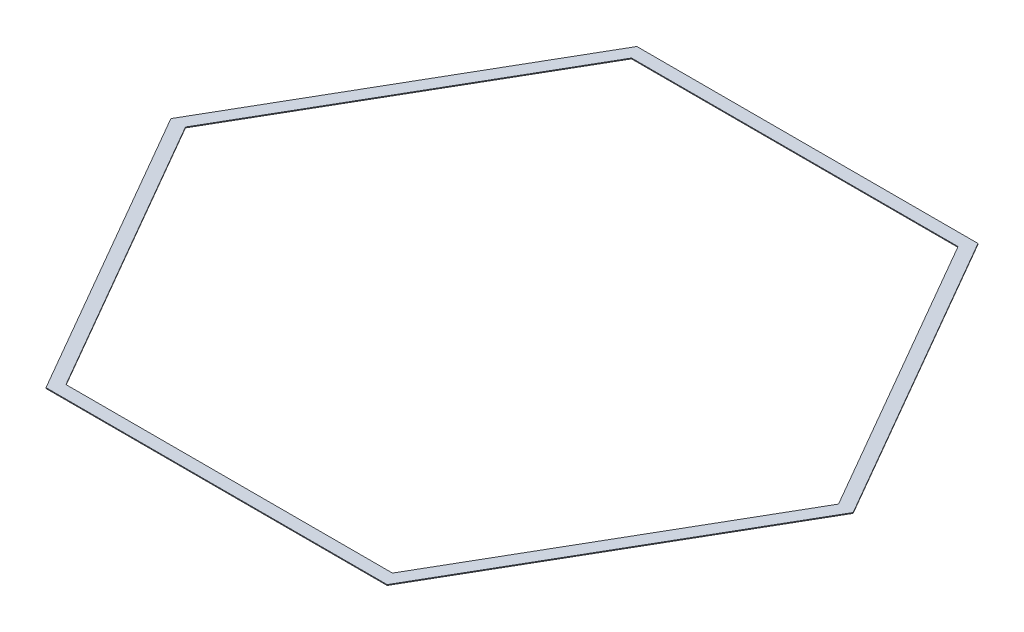
ISO-10303-21;
HEADER;
FILE_DESCRIPTION(('STEP AP214'),'2;1');
FILE_NAME('part.step','',(''),(''),'','','');
FILE_SCHEMA(('AUTOMOTIVE_DESIGN { 1 0 10303 214 1 1 1 1 }'));
ENDSEC;
DATA;
#1=APPLICATION_CONTEXT('core data for automotive mechanical design processes');
#2=APPLICATION_PROTOCOL_DEFINITION('international standard','automotive_design',2000,#1);
#3=PRODUCT_CONTEXT('',#1,'mechanical');
#4=PRODUCT('Part','Part','',(#3));
#5=PRODUCT_RELATED_PRODUCT_CATEGORY('part','',(#4));
#6=PRODUCT_DEFINITION_FORMATION('','',#4);
#7=PRODUCT_DEFINITION_CONTEXT('part definition',#1,'design');
#8=PRODUCT_DEFINITION('design','',#6,#7);
#9=PRODUCT_DEFINITION_SHAPE('','',#8);
#10=(LENGTH_UNIT() NAMED_UNIT(*) SI_UNIT(.MILLI.,.METRE.));
#11=(NAMED_UNIT(*) PLANE_ANGLE_UNIT() SI_UNIT($,.RADIAN.));
#12=(NAMED_UNIT(*) SI_UNIT($,.STERADIAN.) SOLID_ANGLE_UNIT());
#13=UNCERTAINTY_MEASURE_WITH_UNIT(LENGTH_MEASURE(1.E-05),#10,'distance_accuracy_value','');
#14=(GEOMETRIC_REPRESENTATION_CONTEXT(3) GLOBAL_UNCERTAINTY_ASSIGNED_CONTEXT((#13)) GLOBAL_UNIT_ASSIGNED_CONTEXT((#10,
#11,#12)) REPRESENTATION_CONTEXT('',''));
#15=CARTESIAN_POINT('',(0.,0.,0.));
#16=DIRECTION('',(0.,0.,1.));
#17=DIRECTION('',(1.,0.,0.));
#18=AXIS2_PLACEMENT_3D('',#15,#16,#17);
#19=CARTESIAN_POINT('',(0.,3.175,0.));
#20=DIRECTION('',(0.,1.,0.));
#21=DIRECTION('',(0.,0.,1.));
#22=AXIS2_PLACEMENT_3D('',#19,#20,#21);
#23=PLANE('',#22);
#24=DIRECTION('',(-1.,0.,0.));
#25=VECTOR('',#24,1.);
#26=CARTESIAN_POINT('',(685.509319248294,3.175,-1187.33697));
#27=LINE('',#26,#25);
#28=CARTESIAN_POINT('',(685.509319248294,3.175,-1187.33697));
#29=VERTEX_POINT('',#28);
#30=CARTESIAN_POINT('',(-685.509319248295,3.175,-1187.33697));
#31=VERTEX_POINT('',#30);
#32=EDGE_CURVE('E174',#29,#31,#27,.T.);
#33=ORIENTED_EDGE('',*,*,#32,.T.);
#34=DIRECTION('',(-0.5,0.,0.866025403784439));
#35=VECTOR('',#34,1.);
#36=CARTESIAN_POINT('',(-685.509319248295,3.175,-1187.33697));
#37=LINE('',#36,#35);
#38=CARTESIAN_POINT('',(-1371.01863849659,3.175,0.));
#39=VERTEX_POINT('',#38);
#40=EDGE_CURVE('E177',#31,#39,#37,.T.);
#41=ORIENTED_EDGE('',*,*,#40,.T.);
#42=DIRECTION('',(0.5,0.,0.866025403784439));
#43=VECTOR('',#42,1.);
#44=CARTESIAN_POINT('',(-1371.01863849659,3.175,0.));
#45=LINE('',#44,#43);
#46=CARTESIAN_POINT('',(-685.509319248294,3.175,1187.33697));
#47=VERTEX_POINT('',#46);
#48=EDGE_CURVE('E180',#39,#47,#45,.T.);
#49=ORIENTED_EDGE('',*,*,#48,.T.);
#50=DIRECTION('',(1.,0.,0.));
#51=VECTOR('',#50,1.);
#52=CARTESIAN_POINT('',(-685.509319248294,3.175,1187.33697));
#53=LINE('',#52,#51);
#54=CARTESIAN_POINT('',(685.509319248295,3.175,1187.33697));
#55=VERTEX_POINT('',#54);
#56=EDGE_CURVE('E182',#47,#55,#53,.T.);
#57=ORIENTED_EDGE('',*,*,#56,.T.);
#58=DIRECTION('',(0.5,0.,-0.866025403784439));
#59=VECTOR('',#58,1.);
#60=CARTESIAN_POINT('',(685.509319248295,3.175,1187.33697));
#61=LINE('',#60,#59);
#62=CARTESIAN_POINT('',(1371.01863849659,3.175,-3.6429192995513E-13));
#63=VERTEX_POINT('',#62);
#64=EDGE_CURVE('E184',#55,#63,#61,.T.);
#65=ORIENTED_EDGE('',*,*,#64,.T.);
#66=DIRECTION('',(-0.5,0.,-0.866025403784438));
#67=VECTOR('',#66,1.);
#68=CARTESIAN_POINT('',(1371.01863849659,3.175,-3.6429192995513E-13));
#69=LINE('',#68,#67);
#70=EDGE_CURVE('E186',#63,#29,#69,.T.);
#71=ORIENTED_EDGE('',*,*,#70,.T.);
#72=EDGE_LOOP('',(#33,#41,#49,#57,#65,#71));
#73=FACE_BOUND('',#72,.T.);
#74=DIRECTION('',(-0.5,0.,-0.866025403784439));
#75=VECTOR('',#74,1.);
#76=CARTESIAN_POINT('',(1312.35985114692,3.175,-2.21897318819369E-13));
#77=LINE('',#76,#75);
#78=CARTESIAN_POINT('',(1312.35985114692,3.175,-2.21897318819369E-13));
#79=VERTEX_POINT('',#78);
#80=CARTESIAN_POINT('',(656.179925573462,3.175,-1136.53697));
#81=VERTEX_POINT('',#80);
#82=EDGE_CURVE('E131',#79,#81,#77,.T.);
#83=ORIENTED_EDGE('',*,*,#82,.F.);
#84=DIRECTION('',(0.5,0.,-0.866025403784439));
#85=VECTOR('',#84,1.);
#86=CARTESIAN_POINT('',(656.179925573462,3.175,1136.53697));
#87=LINE('',#86,#85);
#88=CARTESIAN_POINT('',(656.179925573462,3.175,1136.53697));
#89=VERTEX_POINT('',#88);
#90=EDGE_CURVE('E123',#89,#79,#87,.T.);
#91=ORIENTED_EDGE('',*,*,#90,.F.);
#92=DIRECTION('',(1.,0.,0.));
#93=VECTOR('',#92,1.);
#94=CARTESIAN_POINT('',(-656.179925573461,3.175,1136.53697));
#95=LINE('',#94,#93);
#96=CARTESIAN_POINT('',(-656.179925573461,3.175,1136.53697));
#97=VERTEX_POINT('',#96);
#98=EDGE_CURVE('E152',#97,#89,#95,.T.);
#99=ORIENTED_EDGE('',*,*,#98,.F.);
#100=DIRECTION('',(0.5,0.,0.866025403784439));
#101=VECTOR('',#100,1.);
#102=CARTESIAN_POINT('',(-1312.35985114692,3.175,0.));
#103=LINE('',#102,#101);
#104=CARTESIAN_POINT('',(-1312.35985114692,3.175,0.));
#105=VERTEX_POINT('',#104);
#106=EDGE_CURVE('E150',#105,#97,#103,.T.);
#107=ORIENTED_EDGE('',*,*,#106,.F.);
#108=DIRECTION('',(-0.5,0.,0.866025403784439));
#109=VECTOR('',#108,1.);
#110=CARTESIAN_POINT('',(-656.179925573462,3.175,-1136.53697));
#111=LINE('',#110,#109);
#112=CARTESIAN_POINT('',(-656.179925573462,3.175,-1136.53697));
#113=VERTEX_POINT('',#112);
#114=EDGE_CURVE('E146',#113,#105,#111,.T.);
#115=ORIENTED_EDGE('',*,*,#114,.F.);
#116=DIRECTION('',(-1.,0.,0.));
#117=VECTOR('',#116,1.);
#118=CARTESIAN_POINT('',(656.179925573462,3.175,-1136.53697));
#119=LINE('',#118,#117);
#120=EDGE_CURVE('E144',#81,#113,#119,.T.);
#121=ORIENTED_EDGE('',*,*,#120,.F.);
#122=EDGE_LOOP('',(#83,#91,#99,#107,#115,#121));
#123=FACE_BOUND('',#122,.T.);
#124=ADVANCED_FACE('F34',(#73,#123),#23,.T.);
#125=CARTESIAN_POINT('',(0.,0.,0.));
#126=DIRECTION('',(0.,1.,0.));
#127=DIRECTION('',(0.,0.,1.));
#128=AXIS2_PLACEMENT_3D('',#125,#126,#127);
#129=PLANE('',#128);
#130=DIRECTION('',(-1.,0.,0.));
#131=VECTOR('',#130,1.);
#132=CARTESIAN_POINT('',(685.509319248294,0.,-1187.33697));
#133=LINE('',#132,#131);
#134=CARTESIAN_POINT('',(685.509319248294,0.,-1187.33697));
#135=VERTEX_POINT('',#134);
#136=CARTESIAN_POINT('',(-685.509319248295,0.,-1187.33697));
#137=VERTEX_POINT('',#136);
#138=EDGE_CURVE('E139',#135,#137,#133,.T.);
#139=ORIENTED_EDGE('',*,*,#138,.F.);
#140=DIRECTION('',(-0.5,0.,-0.866025403784438));
#141=VECTOR('',#140,1.);
#142=CARTESIAN_POINT('',(1371.01863849659,0.,-3.6429192995513E-13));
#143=LINE('',#142,#141);
#144=CARTESIAN_POINT('',(1371.01863849659,0.,-3.6429192995513E-13));
#145=VERTEX_POINT('',#144);
#146=EDGE_CURVE('E178',#145,#135,#143,.T.);
#147=ORIENTED_EDGE('',*,*,#146,.F.);
#148=DIRECTION('',(0.5,0.,-0.866025403784439));
#149=VECTOR('',#148,1.);
#150=CARTESIAN_POINT('',(685.509319248295,0.,1187.33697));
#151=LINE('',#150,#149);
#152=CARTESIAN_POINT('',(685.509319248295,0.,1187.33697));
#153=VERTEX_POINT('',#152);
#154=EDGE_CURVE('E197',#153,#145,#151,.T.);
#155=ORIENTED_EDGE('',*,*,#154,.F.);
#156=DIRECTION('',(1.,0.,0.));
#157=VECTOR('',#156,1.);
#158=CARTESIAN_POINT('',(-685.509319248294,0.,1187.33697));
#159=LINE('',#158,#157);
#160=CARTESIAN_POINT('',(-685.509319248294,0.,1187.33697));
#161=VERTEX_POINT('',#160);
#162=EDGE_CURVE('E195',#161,#153,#159,.T.);
#163=ORIENTED_EDGE('',*,*,#162,.F.);
#164=DIRECTION('',(0.5,0.,0.866025403784439));
#165=VECTOR('',#164,1.);
#166=CARTESIAN_POINT('',(-1371.01863849659,0.,0.));
#167=LINE('',#166,#165);
#168=CARTESIAN_POINT('',(-1371.01863849659,0.,0.));
#169=VERTEX_POINT('',#168);
#170=EDGE_CURVE('E193',#169,#161,#167,.T.);
#171=ORIENTED_EDGE('',*,*,#170,.F.);
#172=DIRECTION('',(-0.5,0.,0.866025403784439));
#173=VECTOR('',#172,1.);
#174=CARTESIAN_POINT('',(-685.509319248295,0.,-1187.33697));
#175=LINE('',#174,#173);
#176=EDGE_CURVE('E191',#137,#169,#175,.T.);
#177=ORIENTED_EDGE('',*,*,#176,.F.);
#178=EDGE_LOOP('',(#139,#147,#155,#163,#171,#177));
#179=FACE_BOUND('',#178,.T.);
#180=DIRECTION('',(0.5,0.,-0.866025403784439));
#181=VECTOR('',#180,1.);
#182=CARTESIAN_POINT('',(656.179925573462,0.,1136.53697));
#183=LINE('',#182,#181);
#184=CARTESIAN_POINT('',(656.179925573462,0.,1136.53697));
#185=VERTEX_POINT('',#184);
#186=CARTESIAN_POINT('',(1312.35985114692,0.,-2.21897318819369E-13));
#187=VERTEX_POINT('',#186);
#188=EDGE_CURVE('E57',#185,#187,#183,.T.);
#189=ORIENTED_EDGE('',*,*,#188,.T.);
#190=DIRECTION('',(-0.5,0.,-0.866025403784439));
#191=VECTOR('',#190,1.);
#192=CARTESIAN_POINT('',(1312.35985114692,0.,-2.21897318819369E-13));
#193=LINE('',#192,#191);
#194=CARTESIAN_POINT('',(656.179925573462,0.,-1136.53697));
#195=VERTEX_POINT('',#194);
#196=EDGE_CURVE('E138',#187,#195,#193,.T.);
#197=ORIENTED_EDGE('',*,*,#196,.T.);
#198=DIRECTION('',(-1.,0.,0.));
#199=VECTOR('',#198,1.);
#200=CARTESIAN_POINT('',(656.179925573462,0.,-1136.53697));
#201=LINE('',#200,#199);
#202=CARTESIAN_POINT('',(-656.179925573462,0.,-1136.53697));
#203=VERTEX_POINT('',#202);
#204=EDGE_CURVE('E156',#195,#203,#201,.T.);
#205=ORIENTED_EDGE('',*,*,#204,.T.);
#206=DIRECTION('',(-0.5,0.,0.866025403784439));
#207=VECTOR('',#206,1.);
#208=CARTESIAN_POINT('',(-656.179925573462,0.,-1136.53697));
#209=LINE('',#208,#207);
#210=CARTESIAN_POINT('',(-1312.35985114692,0.,0.));
#211=VERTEX_POINT('',#210);
#212=EDGE_CURVE('E159',#203,#211,#209,.T.);
#213=ORIENTED_EDGE('',*,*,#212,.T.);
#214=DIRECTION('',(0.5,0.,0.866025403784439));
#215=VECTOR('',#214,1.);
#216=CARTESIAN_POINT('',(-1312.35985114692,0.,0.));
#217=LINE('',#216,#215);
#218=CARTESIAN_POINT('',(-656.179925573461,0.,1136.53697));
#219=VERTEX_POINT('',#218);
#220=EDGE_CURVE('E162',#211,#219,#217,.T.);
#221=ORIENTED_EDGE('',*,*,#220,.T.);
#222=DIRECTION('',(1.,0.,0.));
#223=VECTOR('',#222,1.);
#224=CARTESIAN_POINT('',(-656.179925573461,0.,1136.53697));
#225=LINE('',#224,#223);
#226=EDGE_CURVE('E132',#219,#185,#225,.T.);
#227=ORIENTED_EDGE('',*,*,#226,.T.);
#228=EDGE_LOOP('',(#189,#197,#205,#213,#221,#227));
#229=FACE_BOUND('',#228,.T.);
#230=ADVANCED_FACE('F221',(#179,#229),#129,.F.);
#231=CARTESIAN_POINT('',(685.509319248294,3.175,-1187.33697));
#232=DIRECTION('',(0.,0.,1.));
#233=DIRECTION('',(1.,0.,0.));
#234=AXIS2_PLACEMENT_3D('',#231,#232,#233);
#235=PLANE('',#234);
#236=ORIENTED_EDGE('',*,*,#138,.T.);
#237=DIRECTION('',(0.,-1.,0.));
#238=VECTOR('',#237,1.);
#239=CARTESIAN_POINT('',(-685.509319248295,3.175,-1187.33697));
#240=LINE('',#239,#238);
#241=EDGE_CURVE('E11',#31,#137,#240,.T.);
#242=ORIENTED_EDGE('',*,*,#241,.F.);
#243=ORIENTED_EDGE('',*,*,#32,.F.);
#244=DIRECTION('',(0.,-1.,0.));
#245=VECTOR('',#244,1.);
#246=CARTESIAN_POINT('',(685.509319248294,3.175,-1187.33697));
#247=LINE('',#246,#245);
#248=EDGE_CURVE('E188',#29,#135,#247,.T.);
#249=ORIENTED_EDGE('',*,*,#248,.T.);
#250=EDGE_LOOP('',(#236,#242,#243,#249));
#251=FACE_BOUND('',#250,.T.);
#252=ADVANCED_FACE('F36',(#251),#235,.F.);
#253=CARTESIAN_POINT('',(-685.509319248295,3.175,-1187.33697));
#254=DIRECTION('',(0.866025403784439,0.,0.5));
#255=DIRECTION('',(0.5,0.,-0.866025403784439));
#256=AXIS2_PLACEMENT_3D('',#253,#254,#255);
#257=PLANE('',#256);
#258=ORIENTED_EDGE('',*,*,#176,.T.);
#259=DIRECTION('',(0.,-1.,0.));
#260=VECTOR('',#259,1.);
#261=CARTESIAN_POINT('',(-1371.01863849659,3.175,0.));
#262=LINE('',#261,#260);
#263=EDGE_CURVE('E42',#39,#169,#262,.T.);
#264=ORIENTED_EDGE('',*,*,#263,.F.);
#265=ORIENTED_EDGE('',*,*,#40,.F.);
#266=ORIENTED_EDGE('',*,*,#241,.T.);
#267=EDGE_LOOP('',(#258,#264,#265,#266));
#268=FACE_BOUND('',#267,.T.);
#269=ADVANCED_FACE('F238',(#268),#257,.F.);
#270=CARTESIAN_POINT('',(-1371.01863849659,3.175,0.));
#271=DIRECTION('',(0.866025403784439,0.,-0.5));
#272=DIRECTION('',(-0.5,0.,-0.866025403784439));
#273=AXIS2_PLACEMENT_3D('',#270,#271,#272);
#274=PLANE('',#273);
#275=ORIENTED_EDGE('',*,*,#170,.T.);
#276=DIRECTION('',(0.,-1.,0.));
#277=VECTOR('',#276,1.);
#278=CARTESIAN_POINT('',(-685.509319248294,3.175,1187.33697));
#279=LINE('',#278,#277);
#280=EDGE_CURVE('E208',#47,#161,#279,.T.);
#281=ORIENTED_EDGE('',*,*,#280,.F.);
#282=ORIENTED_EDGE('',*,*,#48,.F.);
#283=ORIENTED_EDGE('',*,*,#263,.T.);
#284=EDGE_LOOP('',(#275,#281,#282,#283));
#285=FACE_BOUND('',#284,.T.);
#286=ADVANCED_FACE('F215',(#285),#274,.F.);
#287=CARTESIAN_POINT('',(-685.509319248294,3.175,1187.33697));
#288=DIRECTION('',(0.,0.,-1.));
#289=DIRECTION('',(-1.,0.,0.));
#290=AXIS2_PLACEMENT_3D('',#287,#288,#289);
#291=PLANE('',#290);
#292=ORIENTED_EDGE('',*,*,#162,.T.);
#293=DIRECTION('',(0.,-1.,0.));
#294=VECTOR('',#293,1.);
#295=CARTESIAN_POINT('',(685.509319248295,3.175,1187.33697));
#296=LINE('',#295,#294);
#297=EDGE_CURVE('E205',#55,#153,#296,.T.);
#298=ORIENTED_EDGE('',*,*,#297,.F.);
#299=ORIENTED_EDGE('',*,*,#56,.F.);
#300=ORIENTED_EDGE('',*,*,#280,.T.);
#301=EDGE_LOOP('',(#292,#298,#299,#300));
#302=FACE_BOUND('',#301,.T.);
#303=ADVANCED_FACE('F227',(#302),#291,.F.);
#304=CARTESIAN_POINT('',(685.509319248295,3.175,1187.33697));
#305=DIRECTION('',(-0.866025403784439,0.,-0.5));
#306=DIRECTION('',(-0.5,0.,0.866025403784439));
#307=AXIS2_PLACEMENT_3D('',#304,#305,#306);
#308=PLANE('',#307);
#309=ORIENTED_EDGE('',*,*,#154,.T.);
#310=DIRECTION('',(0.,-1.,0.));
#311=VECTOR('',#310,1.);
#312=CARTESIAN_POINT('',(1371.01863849659,3.175,-3.6429192995513E-13));
#313=LINE('',#312,#311);
#314=EDGE_CURVE('E202',#63,#145,#313,.T.);
#315=ORIENTED_EDGE('',*,*,#314,.F.);
#316=ORIENTED_EDGE('',*,*,#64,.F.);
#317=ORIENTED_EDGE('',*,*,#297,.T.);
#318=EDGE_LOOP('',(#309,#315,#316,#317));
#319=FACE_BOUND('',#318,.T.);
#320=ADVANCED_FACE('F231',(#319),#308,.F.);
#321=CARTESIAN_POINT('',(1371.01863849659,3.175,-3.6429192995513E-13));
#322=DIRECTION('',(-0.866025403784438,0.,0.5));
#323=DIRECTION('',(0.5,0.,0.866025403784438));
#324=AXIS2_PLACEMENT_3D('',#321,#322,#323);
#325=PLANE('',#324);
#326=ORIENTED_EDGE('',*,*,#146,.T.);
#327=ORIENTED_EDGE('',*,*,#248,.F.);
#328=ORIENTED_EDGE('',*,*,#70,.F.);
#329=ORIENTED_EDGE('',*,*,#314,.T.);
#330=EDGE_LOOP('',(#326,#327,#328,#329));
#331=FACE_BOUND('',#330,.T.);
#332=ADVANCED_FACE('F241',(#331),#325,.F.);
#333=CARTESIAN_POINT('',(656.179925573462,3.175,1136.53697));
#334=DIRECTION('',(-0.866025403784439,0.,-0.5));
#335=DIRECTION('',(-0.5,0.,0.866025403784439));
#336=AXIS2_PLACEMENT_3D('',#333,#334,#335);
#337=PLANE('',#336);
#338=ORIENTED_EDGE('',*,*,#188,.F.);
#339=DIRECTION('',(0.,-1.,0.));
#340=VECTOR('',#339,1.);
#341=CARTESIAN_POINT('',(656.179925573462,3.175,1136.53697));
#342=LINE('',#341,#340);
#343=EDGE_CURVE('E127',#89,#185,#342,.T.);
#344=ORIENTED_EDGE('',*,*,#343,.F.);
#345=ORIENTED_EDGE('',*,*,#90,.T.);
#346=DIRECTION('',(0.,-1.,0.));
#347=VECTOR('',#346,1.);
#348=CARTESIAN_POINT('',(1312.35985114692,3.175,-2.21897318819369E-13));
#349=LINE('',#348,#347);
#350=EDGE_CURVE('E126',#79,#187,#349,.T.);
#351=ORIENTED_EDGE('',*,*,#350,.T.);
#352=EDGE_LOOP('',(#338,#344,#345,#351));
#353=FACE_BOUND('',#352,.T.);
#354=ADVANCED_FACE('F125',(#353),#337,.T.);
#355=CARTESIAN_POINT('',(1312.35985114692,3.175,-2.21897318819369E-13));
#356=DIRECTION('',(-0.866025403784439,0.,0.5));
#357=DIRECTION('',(0.5,0.,0.866025403784439));
#358=AXIS2_PLACEMENT_3D('',#355,#356,#357);
#359=PLANE('',#358);
#360=ORIENTED_EDGE('',*,*,#196,.F.);
#361=ORIENTED_EDGE('',*,*,#350,.F.);
#362=ORIENTED_EDGE('',*,*,#82,.T.);
#363=DIRECTION('',(0.,-1.,0.));
#364=VECTOR('',#363,1.);
#365=CARTESIAN_POINT('',(656.179925573462,3.175,-1136.53697));
#366=LINE('',#365,#364);
#367=EDGE_CURVE('E140',#81,#195,#366,.T.);
#368=ORIENTED_EDGE('',*,*,#367,.T.);
#369=EDGE_LOOP('',(#360,#361,#362,#368));
#370=FACE_BOUND('',#369,.T.);
#371=ADVANCED_FACE('F135',(#370),#359,.T.);
#372=CARTESIAN_POINT('',(656.179925573462,3.175,-1136.53697));
#373=DIRECTION('',(0.,0.,1.));
#374=DIRECTION('',(1.,0.,0.));
#375=AXIS2_PLACEMENT_3D('',#372,#373,#374);
#376=PLANE('',#375);
#377=ORIENTED_EDGE('',*,*,#204,.F.);
#378=ORIENTED_EDGE('',*,*,#367,.F.);
#379=ORIENTED_EDGE('',*,*,#120,.T.);
#380=DIRECTION('',(0.,-1.,0.));
#381=VECTOR('',#380,1.);
#382=CARTESIAN_POINT('',(-656.179925573462,3.175,-1136.53697));
#383=LINE('',#382,#381);
#384=EDGE_CURVE('E171',#113,#203,#383,.T.);
#385=ORIENTED_EDGE('',*,*,#384,.T.);
#386=EDGE_LOOP('',(#377,#378,#379,#385));
#387=FACE_BOUND('',#386,.T.);
#388=ADVANCED_FACE('F259',(#387),#376,.T.);
#389=CARTESIAN_POINT('',(-656.179925573462,3.175,-1136.53697));
#390=DIRECTION('',(0.866025403784439,0.,0.5));
#391=DIRECTION('',(0.5,0.,-0.866025403784439));
#392=AXIS2_PLACEMENT_3D('',#389,#390,#391);
#393=PLANE('',#392);
#394=ORIENTED_EDGE('',*,*,#212,.F.);
#395=ORIENTED_EDGE('',*,*,#384,.F.);
#396=ORIENTED_EDGE('',*,*,#114,.T.);
#397=DIRECTION('',(0.,-1.,0.));
#398=VECTOR('',#397,1.);
#399=CARTESIAN_POINT('',(-1312.35985114692,3.175,0.));
#400=LINE('',#399,#398);
#401=EDGE_CURVE('E169',#105,#211,#400,.T.);
#402=ORIENTED_EDGE('',*,*,#401,.T.);
#403=EDGE_LOOP('',(#394,#395,#396,#402));
#404=FACE_BOUND('',#403,.T.);
#405=ADVANCED_FACE('F262',(#404),#393,.T.);
#406=CARTESIAN_POINT('',(-1312.35985114692,3.175,0.));
#407=DIRECTION('',(0.866025403784439,0.,-0.5));
#408=DIRECTION('',(-0.5,0.,-0.866025403784439));
#409=AXIS2_PLACEMENT_3D('',#406,#407,#408);
#410=PLANE('',#409);
#411=ORIENTED_EDGE('',*,*,#220,.F.);
#412=ORIENTED_EDGE('',*,*,#401,.F.);
#413=ORIENTED_EDGE('',*,*,#106,.T.);
#414=DIRECTION('',(0.,-1.,0.));
#415=VECTOR('',#414,1.);
#416=CARTESIAN_POINT('',(-656.179925573461,3.175,1136.53697));
#417=LINE('',#416,#415);
#418=EDGE_CURVE('E49',#97,#219,#417,.T.);
#419=ORIENTED_EDGE('',*,*,#418,.T.);
#420=EDGE_LOOP('',(#411,#412,#413,#419));
#421=FACE_BOUND('',#420,.T.);
#422=ADVANCED_FACE('F266',(#421),#410,.T.);
#423=CARTESIAN_POINT('',(-656.179925573461,3.175,1136.53697));
#424=DIRECTION('',(0.,0.,-1.));
#425=DIRECTION('',(-1.,0.,0.));
#426=AXIS2_PLACEMENT_3D('',#423,#424,#425);
#427=PLANE('',#426);
#428=ORIENTED_EDGE('',*,*,#226,.F.);
#429=ORIENTED_EDGE('',*,*,#418,.F.);
#430=ORIENTED_EDGE('',*,*,#98,.T.);
#431=ORIENTED_EDGE('',*,*,#343,.T.);
#432=EDGE_LOOP('',(#428,#429,#430,#431));
#433=FACE_BOUND('',#432,.T.);
#434=ADVANCED_FACE('F270',(#433),#427,.T.);
#435=CLOSED_SHELL('',(#124,#230,#252,#269,#286,#303,#320,#332,#354,#371,#388,#405,#422,#434));
#436=MANIFOLD_SOLID_BREP('B2',#435);
#437=ADVANCED_BREP_SHAPE_REPRESENTATION('',(#18,#436),#14);
#438=SHAPE_DEFINITION_REPRESENTATION(#9,#437);
ENDSEC;
END-ISO-10303-21;
